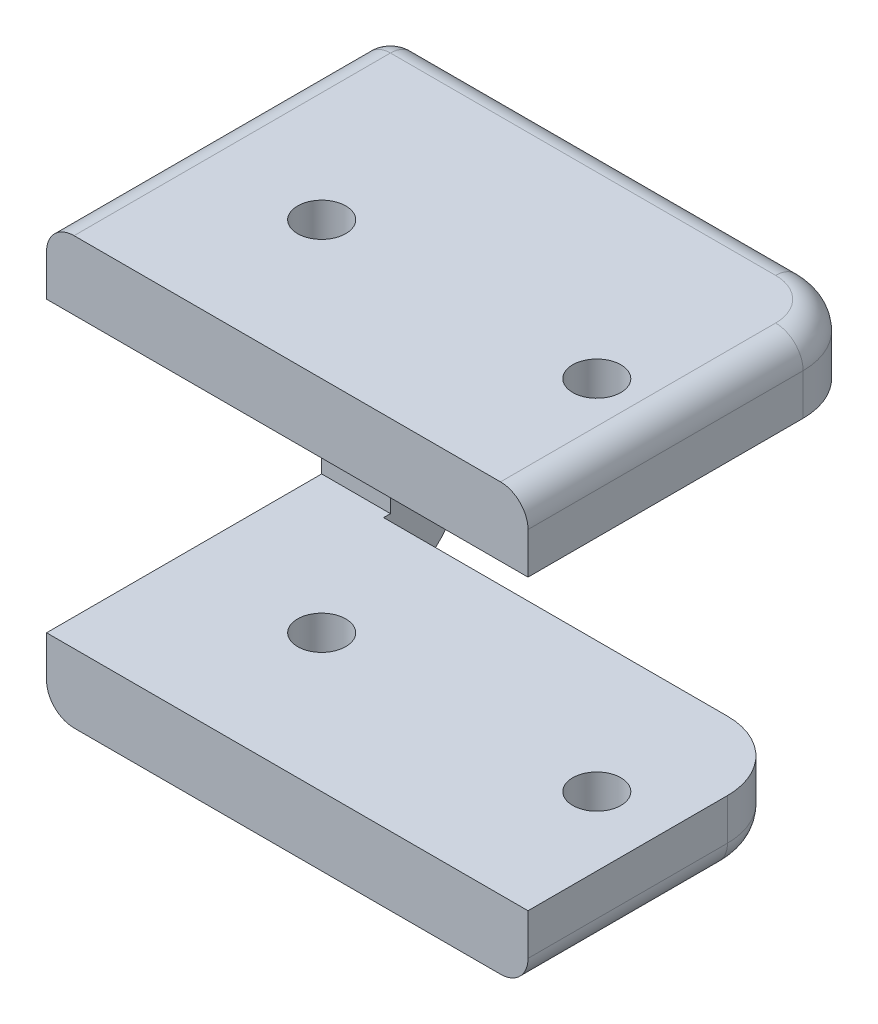
ISO-10303-21;
HEADER;
FILE_DESCRIPTION(('STEP AP214'),'2;1');
FILE_NAME('part.step','',(''),(''),'','','');
FILE_SCHEMA(('AUTOMOTIVE_DESIGN { 1 0 10303 214 1 1 1 1 }'));
ENDSEC;
DATA;
#1=APPLICATION_CONTEXT('core data for automotive mechanical design processes');
#2=APPLICATION_PROTOCOL_DEFINITION('international standard','automotive_design',2000,#1);
#3=PRODUCT_CONTEXT('',#1,'mechanical');
#4=PRODUCT('Part','Part','',(#3));
#5=PRODUCT_RELATED_PRODUCT_CATEGORY('part','',(#4));
#6=PRODUCT_DEFINITION_FORMATION('','',#4);
#7=PRODUCT_DEFINITION_CONTEXT('part definition',#1,'design');
#8=PRODUCT_DEFINITION('design','',#6,#7);
#9=PRODUCT_DEFINITION_SHAPE('','',#8);
#10=(LENGTH_UNIT() NAMED_UNIT(*) SI_UNIT(.MILLI.,.METRE.));
#11=(NAMED_UNIT(*) PLANE_ANGLE_UNIT() SI_UNIT($,.RADIAN.));
#12=(NAMED_UNIT(*) SI_UNIT($,.STERADIAN.) SOLID_ANGLE_UNIT());
#13=UNCERTAINTY_MEASURE_WITH_UNIT(LENGTH_MEASURE(1.E-05),#10,'distance_accuracy_value','');
#14=(GEOMETRIC_REPRESENTATION_CONTEXT(3) GLOBAL_UNCERTAINTY_ASSIGNED_CONTEXT((#13)) GLOBAL_UNIT_ASSIGNED_CONTEXT((#10,
#11,#12)) REPRESENTATION_CONTEXT('',''));
#15=CARTESIAN_POINT('',(0.,0.,0.));
#16=DIRECTION('',(0.,0.,1.));
#17=DIRECTION('',(1.,0.,0.));
#18=AXIS2_PLACEMENT_3D('',#15,#16,#17);
#19=CARTESIAN_POINT('',(-15.,0.,0.));
#20=DIRECTION('',(-1.,0.,0.));
#21=DIRECTION('',(0.,0.,1.));
#22=AXIS2_PLACEMENT_3D('',#19,#20,#21);
#23=PLANE('',#22);
#24=DIRECTION('',(0.,0.,1.));
#25=VECTOR('',#24,1.);
#26=CARTESIAN_POINT('',(-15.,-26.,-12.5));
#27=LINE('',#26,#25);
#28=CARTESIAN_POINT('',(-15.,-26.,-7.5));
#29=VERTEX_POINT('',#28);
#30=CARTESIAN_POINT('',(-15.,-26.,-4.99999999999999));
#31=VERTEX_POINT('',#30);
#32=EDGE_CURVE('E234',#29,#31,#27,.T.);
#33=ORIENTED_EDGE('',*,*,#32,.F.);
#34=CARTESIAN_POINT('',(-15.,-21.,-7.5));
#35=DIRECTION('',(-1.,0.,0.));
#36=DIRECTION('',(0.,0.,1.));
#37=AXIS2_PLACEMENT_3D('',#34,#35,#36);
#38=CIRCLE('',#37,5.);
#39=CARTESIAN_POINT('',(-15.,-21.,-12.5));
#40=VERTEX_POINT('',#39);
#41=EDGE_CURVE('E280',#29,#40,#38,.F.);
#42=ORIENTED_EDGE('',*,*,#41,.T.);
#43=DIRECTION('',(0.,-1.,0.));
#44=VECTOR('',#43,1.);
#45=CARTESIAN_POINT('',(-15.,5.,-12.5));
#46=LINE('',#45,#44);
#47=CARTESIAN_POINT('',(-15.,0.,-12.5));
#48=VERTEX_POINT('',#47);
#49=EDGE_CURVE('E218',#48,#40,#46,.T.);
#50=ORIENTED_EDGE('',*,*,#49,.F.);
#51=DIRECTION('',(0.,0.,1.));
#52=VECTOR('',#51,1.);
#53=CARTESIAN_POINT('',(-15.,0.,-12.5));
#54=LINE('',#53,#52);
#55=CARTESIAN_POINT('',(-15.,0.,-7.49999999999999));
#56=VERTEX_POINT('',#55);
#57=EDGE_CURVE('E267',#48,#56,#54,.T.);
#58=ORIENTED_EDGE('',*,*,#57,.T.);
#59=DIRECTION('',(0.,1.,0.));
#60=VECTOR('',#59,1.);
#61=CARTESIAN_POINT('',(-15.,-21.,-7.49999999999999));
#62=LINE('',#61,#60);
#63=CARTESIAN_POINT('',(-15.,-21.,-7.49999999999999));
#64=VERTEX_POINT('',#63);
#65=EDGE_CURVE('E221',#64,#56,#62,.T.);
#66=ORIENTED_EDGE('',*,*,#65,.F.);
#67=DIRECTION('',(0.,0.,-1.));
#68=VECTOR('',#67,1.);
#69=CARTESIAN_POINT('',(-15.,-21.,12.5));
#70=LINE('',#69,#68);
#71=CARTESIAN_POINT('',(-15.,-21.,-6.99999999999999));
#72=VERTEX_POINT('',#71);
#73=EDGE_CURVE('E236',#72,#64,#70,.T.);
#74=ORIENTED_EDGE('',*,*,#73,.F.);
#75=DIRECTION('',(0.,1.,0.));
#76=VECTOR('',#75,1.);
#77=CARTESIAN_POINT('',(-15.,-26.,-6.99999999999999));
#78=LINE('',#77,#76);
#79=CARTESIAN_POINT('',(-15.,-24.,-6.99999999999999));
#80=VERTEX_POINT('',#79);
#81=EDGE_CURVE('E208',#80,#72,#78,.T.);
#82=ORIENTED_EDGE('',*,*,#81,.F.);
#83=CARTESIAN_POINT('',(-15.,-24.,-4.99999999999999));
#84=DIRECTION('',(-1.,0.,0.));
#85=DIRECTION('',(0.,0.,1.));
#86=AXIS2_PLACEMENT_3D('',#83,#84,#85);
#87=CIRCLE('',#86,2.);
#88=EDGE_CURVE('E11',#80,#31,#87,.T.);
#89=ORIENTED_EDGE('',*,*,#88,.T.);
#90=EDGE_LOOP('',(#33,#42,#50,#58,#66,#74,#82,#89));
#91=FACE_BOUND('',#90,.T.);
#92=ADVANCED_FACE('F36',(#91),#23,.F.);
#93=CARTESIAN_POINT('',(0.,5.,0.));
#94=DIRECTION('',(0.,1.,0.));
#95=DIRECTION('',(0.,0.,1.));
#96=AXIS2_PLACEMENT_3D('',#93,#94,#95);
#97=PLANE('',#96);
#98=CARTESIAN_POINT('',(-10.,5.,2.50000000000001));
#99=DIRECTION('',(0.,1.,0.));
#100=DIRECTION('',(0.,0.,1.));
#101=AXIS2_PLACEMENT_3D('',#98,#99,#100);
#102=CIRCLE('',#101,1.75000000000001);
#103=CARTESIAN_POINT('',(-10.,5.,4.25000000000002));
#104=VERTEX_POINT('',#103);
#105=EDGE_CURVE('E252',#104,#104,#102,.T.);
#106=ORIENTED_EDGE('',*,*,#105,.F.);
#107=EDGE_LOOP('',(#106));
#108=FACE_BOUND('',#107,.T.);
#109=DIRECTION('',(1.,0.,0.));
#110=VECTOR('',#109,1.);
#111=CARTESIAN_POINT('',(-15.,5.,12.5));
#112=LINE('',#111,#110);
#113=CARTESIAN_POINT('',(-18.,5.,12.5));
#114=VERTEX_POINT('',#113);
#115=CARTESIAN_POINT('',(13.,5.,12.5));
#116=VERTEX_POINT('',#115);
#117=EDGE_CURVE('E258',#114,#116,#112,.T.);
#118=ORIENTED_EDGE('',*,*,#117,.T.);
#119=DIRECTION('',(0.,0.,-1.));
#120=VECTOR('',#119,1.);
#121=CARTESIAN_POINT('',(13.,5.,-7.5));
#122=LINE('',#121,#120);
#123=CARTESIAN_POINT('',(13.,5.,-7.5));
#124=VERTEX_POINT('',#123);
#125=EDGE_CURVE('E328',#116,#124,#122,.T.);
#126=ORIENTED_EDGE('',*,*,#125,.T.);
#127=CARTESIAN_POINT('',(10.,5.,-7.5));
#128=DIRECTION('',(0.,1.,0.));
#129=DIRECTION('',(0.,0.,1.));
#130=AXIS2_PLACEMENT_3D('',#127,#128,#129);
#131=CIRCLE('',#130,3.);
#132=CARTESIAN_POINT('',(10.,5.,-10.5));
#133=VERTEX_POINT('',#132);
#134=EDGE_CURVE('E326',#124,#133,#131,.T.);
#135=ORIENTED_EDGE('',*,*,#134,.T.);
#136=DIRECTION('',(-1.,0.,0.));
#137=VECTOR('',#136,1.);
#138=CARTESIAN_POINT('',(-20.,5.,-10.5));
#139=LINE('',#138,#137);
#140=CARTESIAN_POINT('',(-18.,5.,-10.5));
#141=VERTEX_POINT('',#140);
#142=EDGE_CURVE('E324',#133,#141,#139,.T.);
#143=ORIENTED_EDGE('',*,*,#142,.T.);
#144=DIRECTION('',(0.,0.,-1.));
#145=VECTOR('',#144,1.);
#146=CARTESIAN_POINT('',(-18.,5.,0.));
#147=LINE('',#146,#145);
#148=EDGE_CURVE('E322',#141,#114,#147,.F.);
#149=ORIENTED_EDGE('',*,*,#148,.T.);
#150=EDGE_LOOP('',(#118,#126,#135,#143,#149));
#151=FACE_BOUND('',#150,.T.);
#152=CARTESIAN_POINT('',(10.,5.,2.50000000000001));
#153=DIRECTION('',(0.,1.,0.));
#154=DIRECTION('',(0.,0.,1.));
#155=AXIS2_PLACEMENT_3D('',#152,#153,#154);
#156=CIRCLE('',#155,1.74999999999987);
#157=CARTESIAN_POINT('',(10.,5.,4.24999999999988));
#158=VERTEX_POINT('',#157);
#159=EDGE_CURVE('E246',#158,#158,#156,.T.);
#160=ORIENTED_EDGE('',*,*,#159,.F.);
#161=EDGE_LOOP('',(#160));
#162=FACE_BOUND('',#161,.T.);
#163=ADVANCED_FACE('F380',(#108,#151,#162),#97,.T.);
#164=CARTESIAN_POINT('',(0.,0.,0.));
#165=DIRECTION('',(0.,1.,0.));
#166=DIRECTION('',(0.,0.,1.));
#167=AXIS2_PLACEMENT_3D('',#164,#165,#166);
#168=PLANE('',#167);
#169=DIRECTION('',(-1.,0.,0.));
#170=VECTOR('',#169,1.);
#171=CARTESIAN_POINT('',(-15.,0.,-12.5));
#172=LINE('',#171,#170);
#173=CARTESIAN_POINT('',(10.,0.,-12.5));
#174=VERTEX_POINT('',#173);
#175=EDGE_CURVE('E265',#174,#48,#172,.T.);
#176=ORIENTED_EDGE('',*,*,#175,.F.);
#177=CARTESIAN_POINT('',(10.,0.,-7.5));
#178=DIRECTION('',(0.,1.,0.));
#179=DIRECTION('',(0.,0.,1.));
#180=AXIS2_PLACEMENT_3D('',#177,#178,#179);
#181=CIRCLE('',#180,5.);
#182=CARTESIAN_POINT('',(15.,0.,-7.5));
#183=VERTEX_POINT('',#182);
#184=EDGE_CURVE('E292',#174,#183,#181,.F.);
#185=ORIENTED_EDGE('',*,*,#184,.T.);
#186=DIRECTION('',(0.,0.,-1.));
#187=VECTOR('',#186,1.);
#188=CARTESIAN_POINT('',(15.,0.,-12.5));
#189=LINE('',#188,#187);
#190=CARTESIAN_POINT('',(15.,0.,12.5));
#191=VERTEX_POINT('',#190);
#192=EDGE_CURVE('E255',#191,#183,#189,.T.);
#193=ORIENTED_EDGE('',*,*,#192,.F.);
#194=DIRECTION('',(1.,0.,0.));
#195=VECTOR('',#194,1.);
#196=CARTESIAN_POINT('',(-15.,0.,12.5));
#197=LINE('',#196,#195);
#198=CARTESIAN_POINT('',(-20.,0.,12.5));
#199=VERTEX_POINT('',#198);
#200=EDGE_CURVE('E262',#199,#191,#197,.T.);
#201=ORIENTED_EDGE('',*,*,#200,.F.);
#202=DIRECTION('',(0.,0.,1.));
#203=VECTOR('',#202,1.);
#204=CARTESIAN_POINT('',(-20.,0.,12.5));
#205=LINE('',#204,#203);
#206=CARTESIAN_POINT('',(-20.,0.,-7.49999999999999));
#207=VERTEX_POINT('',#206);
#208=EDGE_CURVE('E225',#207,#199,#205,.T.);
#209=ORIENTED_EDGE('',*,*,#208,.F.);
#210=DIRECTION('',(1.,0.,0.));
#211=VECTOR('',#210,1.);
#212=CARTESIAN_POINT('',(-20.,0.,-7.49999999999999));
#213=LINE('',#212,#211);
#214=EDGE_CURVE('E231',#207,#56,#213,.T.);
#215=ORIENTED_EDGE('',*,*,#214,.T.);
#216=ORIENTED_EDGE('',*,*,#57,.F.);
#217=EDGE_LOOP('',(#176,#185,#193,#201,#209,#215,#216));
#218=FACE_BOUND('',#217,.T.);
#219=CARTESIAN_POINT('',(-10.,0.,2.50000000000001));
#220=DIRECTION('',(0.,1.,0.));
#221=DIRECTION('',(0.,0.,1.));
#222=AXIS2_PLACEMENT_3D('',#219,#220,#221);
#223=CIRCLE('',#222,1.75000000000001);
#224=CARTESIAN_POINT('',(-10.,0.,4.25000000000002));
#225=VERTEX_POINT('',#224);
#226=EDGE_CURVE('E249',#225,#225,#223,.T.);
#227=ORIENTED_EDGE('',*,*,#226,.T.);
#228=EDGE_LOOP('',(#227));
#229=FACE_BOUND('',#228,.T.);
#230=CARTESIAN_POINT('',(10.,0.,2.50000000000001));
#231=DIRECTION('',(0.,1.,0.));
#232=DIRECTION('',(0.,0.,1.));
#233=AXIS2_PLACEMENT_3D('',#230,#231,#232);
#234=CIRCLE('',#233,1.74999999999987);
#235=CARTESIAN_POINT('',(10.,0.,4.24999999999988));
#236=VERTEX_POINT('',#235);
#237=EDGE_CURVE('E245',#236,#236,#234,.T.);
#238=ORIENTED_EDGE('',*,*,#237,.T.);
#239=EDGE_LOOP('',(#238));
#240=FACE_BOUND('',#239,.T.);
#241=ADVANCED_FACE('F406',(#218,#229,#240),#168,.F.);
#242=CARTESIAN_POINT('',(15.,5.,-12.5));
#243=DIRECTION('',(-1.,0.,0.));
#244=DIRECTION('',(0.,0.,1.));
#245=AXIS2_PLACEMENT_3D('',#242,#243,#244);
#246=PLANE('',#245);
#247=DIRECTION('',(0.,-1.,0.));
#248=VECTOR('',#247,1.);
#249=CARTESIAN_POINT('',(15.,5.,-7.5));
#250=LINE('',#249,#248);
#251=CARTESIAN_POINT('',(15.,3.,-7.5));
#252=VERTEX_POINT('',#251);
#253=EDGE_CURVE('E294',#183,#252,#250,.F.);
#254=ORIENTED_EDGE('',*,*,#253,.T.);
#255=DIRECTION('',(0.,0.,-1.));
#256=VECTOR('',#255,1.);
#257=CARTESIAN_POINT('',(15.,3.,12.5));
#258=LINE('',#257,#256);
#259=CARTESIAN_POINT('',(15.,3.,12.5));
#260=VERTEX_POINT('',#259);
#261=EDGE_CURVE('E53',#252,#260,#258,.F.);
#262=ORIENTED_EDGE('',*,*,#261,.T.);
#263=DIRECTION('',(0.,-1.,0.));
#264=VECTOR('',#263,1.);
#265=CARTESIAN_POINT('',(15.,5.,12.5));
#266=LINE('',#265,#264);
#267=EDGE_CURVE('E261',#260,#191,#266,.T.);
#268=ORIENTED_EDGE('',*,*,#267,.T.);
#269=ORIENTED_EDGE('',*,*,#192,.T.);
#270=EDGE_LOOP('',(#254,#262,#268,#269));
#271=FACE_BOUND('',#270,.T.);
#272=ADVANCED_FACE('F410',(#271),#246,.F.);
#273=CARTESIAN_POINT('',(-15.,5.,-12.5));
#274=DIRECTION('',(0.,0.,1.));
#275=DIRECTION('',(1.,0.,0.));
#276=AXIS2_PLACEMENT_3D('',#273,#274,#275);
#277=PLANE('',#276);
#278=DIRECTION('',(0.,-1.,0.));
#279=VECTOR('',#278,1.);
#280=CARTESIAN_POINT('',(-18.,5.,-12.5));
#281=LINE('',#280,#279);
#282=CARTESIAN_POINT('',(-18.,-21.,-12.5));
#283=VERTEX_POINT('',#282);
#284=CARTESIAN_POINT('',(-18.,3.,-12.5));
#285=VERTEX_POINT('',#284);
#286=EDGE_CURVE('E330',#283,#285,#281,.F.);
#287=ORIENTED_EDGE('',*,*,#286,.T.);
#288=DIRECTION('',(-1.,0.,0.));
#289=VECTOR('',#288,1.);
#290=CARTESIAN_POINT('',(10.,3.,-12.5));
#291=LINE('',#290,#289);
#292=CARTESIAN_POINT('',(10.,3.,-12.5));
#293=VERTEX_POINT('',#292);
#294=EDGE_CURVE('E332',#285,#293,#291,.F.);
#295=ORIENTED_EDGE('',*,*,#294,.T.);
#296=DIRECTION('',(0.,-1.,0.));
#297=VECTOR('',#296,1.);
#298=CARTESIAN_POINT('',(10.,5.,-12.5));
#299=LINE('',#298,#297);
#300=EDGE_CURVE('E282',#293,#174,#299,.T.);
#301=ORIENTED_EDGE('',*,*,#300,.T.);
#302=ORIENTED_EDGE('',*,*,#175,.T.);
#303=ORIENTED_EDGE('',*,*,#49,.T.);
#304=DIRECTION('',(1.,0.,0.));
#305=VECTOR('',#304,1.);
#306=CARTESIAN_POINT('',(-15.,-21.,-12.5));
#307=LINE('',#306,#305);
#308=EDGE_CURVE('E284',#40,#283,#307,.F.);
#309=ORIENTED_EDGE('',*,*,#308,.T.);
#310=EDGE_LOOP('',(#287,#295,#301,#302,#303,#309));
#311=FACE_BOUND('',#310,.T.);
#312=ADVANCED_FACE('F415',(#311),#277,.F.);
#313=CARTESIAN_POINT('',(-15.,5.,12.5));
#314=DIRECTION('',(0.,0.,-1.));
#315=DIRECTION('',(-1.,0.,0.));
#316=AXIS2_PLACEMENT_3D('',#313,#314,#315);
#317=PLANE('',#316);
#318=ORIENTED_EDGE('',*,*,#267,.F.);
#319=CARTESIAN_POINT('',(13.,3.,12.5));
#320=DIRECTION('',(0.,0.,-1.));
#321=DIRECTION('',(-1.,0.,0.));
#322=AXIS2_PLACEMENT_3D('',#319,#320,#321);
#323=CIRCLE('',#322,2.);
#324=EDGE_CURVE('E45',#260,#116,#323,.F.);
#325=ORIENTED_EDGE('',*,*,#324,.T.);
#326=ORIENTED_EDGE('',*,*,#117,.F.);
#327=CARTESIAN_POINT('',(-18.,3.,12.5));
#328=DIRECTION('',(0.,0.,-1.));
#329=DIRECTION('',(-1.,0.,0.));
#330=AXIS2_PLACEMENT_3D('',#327,#328,#329);
#331=CIRCLE('',#330,2.);
#332=CARTESIAN_POINT('',(-20.,3.,12.5));
#333=VERTEX_POINT('',#332);
#334=EDGE_CURVE('E338',#114,#333,#331,.F.);
#335=ORIENTED_EDGE('',*,*,#334,.T.);
#336=DIRECTION('',(0.,1.,0.));
#337=VECTOR('',#336,1.);
#338=CARTESIAN_POINT('',(-20.,5.,12.5));
#339=LINE('',#338,#337);
#340=EDGE_CURVE('E228',#199,#333,#339,.T.);
#341=ORIENTED_EDGE('',*,*,#340,.F.);
#342=ORIENTED_EDGE('',*,*,#200,.T.);
#343=EDGE_LOOP('',(#318,#325,#326,#335,#341,#342));
#344=FACE_BOUND('',#343,.T.);
#345=ADVANCED_FACE('F377',(#344),#317,.F.);
#346=CARTESIAN_POINT('',(-10.,5.,2.50000000000001));
#347=DIRECTION('',(0.,-1.,0.));
#348=DIRECTION('',(0.,0.,-1.));
#349=AXIS2_PLACEMENT_3D('',#346,#347,#348);
#350=CYLINDRICAL_SURFACE('',#349,1.75000000000001);
#351=ORIENTED_EDGE('',*,*,#105,.T.);
#352=EDGE_LOOP('',(#351));
#353=FACE_BOUND('',#352,.T.);
#354=ORIENTED_EDGE('',*,*,#226,.F.);
#355=EDGE_LOOP('',(#354));
#356=FACE_BOUND('',#355,.T.);
#357=ADVANCED_FACE('F492',(#353,#356),#350,.F.);
#358=CARTESIAN_POINT('',(10.,5.,2.50000000000001));
#359=DIRECTION('',(0.,-1.,0.));
#360=DIRECTION('',(0.,0.,-1.));
#361=AXIS2_PLACEMENT_3D('',#358,#359,#360);
#362=CYLINDRICAL_SURFACE('',#361,1.74999999999987);
#363=ORIENTED_EDGE('',*,*,#159,.T.);
#364=EDGE_LOOP('',(#363));
#365=FACE_BOUND('',#364,.T.);
#366=ORIENTED_EDGE('',*,*,#237,.F.);
#367=EDGE_LOOP('',(#366));
#368=FACE_BOUND('',#367,.T.);
#369=ADVANCED_FACE('F488',(#365,#368),#362,.F.);
#370=CARTESIAN_POINT('',(-20.,-26.,-12.5));
#371=DIRECTION('',(0.,1.,0.));
#372=DIRECTION('',(0.,0.,1.));
#373=AXIS2_PLACEMENT_3D('',#370,#371,#372);
#374=PLANE('',#373);
#375=CARTESIAN_POINT('',(-10.,-26.,2.50000000000001));
#376=DIRECTION('',(0.,-1.,0.));
#377=DIRECTION('',(0.,0.,-1.));
#378=AXIS2_PLACEMENT_3D('',#375,#376,#377);
#379=CIRCLE('',#378,1.75);
#380=CARTESIAN_POINT('',(-10.,-26.,0.75000000000001));
#381=VERTEX_POINT('',#380);
#382=EDGE_CURVE('E276',#381,#381,#379,.T.);
#383=ORIENTED_EDGE('',*,*,#382,.F.);
#384=EDGE_LOOP('',(#383));
#385=FACE_BOUND('',#384,.T.);
#386=CARTESIAN_POINT('',(10.,-26.,2.50000000000001));
#387=DIRECTION('',(0.,-1.,0.));
#388=DIRECTION('',(0.,0.,-1.));
#389=AXIS2_PLACEMENT_3D('',#386,#387,#388);
#390=CIRCLE('',#389,1.75);
#391=CARTESIAN_POINT('',(10.,-26.,0.75000000000001));
#392=VERTEX_POINT('',#391);
#393=EDGE_CURVE('E213',#392,#392,#390,.T.);
#394=ORIENTED_EDGE('',*,*,#393,.F.);
#395=EDGE_LOOP('',(#394));
#396=FACE_BOUND('',#395,.T.);
#397=DIRECTION('',(1.,0.,0.));
#398=VECTOR('',#397,1.);
#399=CARTESIAN_POINT('',(-20.,-26.,12.5));
#400=LINE('',#399,#398);
#401=CARTESIAN_POINT('',(-18.,-26.,12.5));
#402=VERTEX_POINT('',#401);
#403=CARTESIAN_POINT('',(13.,-26.,12.5));
#404=VERTEX_POINT('',#403);
#405=EDGE_CURVE('E201',#402,#404,#400,.T.);
#406=ORIENTED_EDGE('',*,*,#405,.F.);
#407=DIRECTION('',(0.,0.,1.));
#408=VECTOR('',#407,1.);
#409=CARTESIAN_POINT('',(-18.,-26.,-7.5));
#410=LINE('',#409,#408);
#411=CARTESIAN_POINT('',(-18.,-26.,-7.5));
#412=VERTEX_POINT('',#411);
#413=EDGE_CURVE('E304',#402,#412,#410,.F.);
#414=ORIENTED_EDGE('',*,*,#413,.T.);
#415=DIRECTION('',(1.,0.,0.));
#416=VECTOR('',#415,1.);
#417=CARTESIAN_POINT('',(-20.,-26.,-7.5));
#418=LINE('',#417,#416);
#419=EDGE_CURVE('E272',#412,#29,#418,.T.);
#420=ORIENTED_EDGE('',*,*,#419,.T.);
#421=ORIENTED_EDGE('',*,*,#32,.T.);
#422=DIRECTION('',(-1.,0.,0.));
#423=VECTOR('',#422,1.);
#424=CARTESIAN_POINT('',(-20.,-26.,-4.99999999999999));
#425=LINE('',#424,#423);
#426=CARTESIAN_POINT('',(10.,-26.,-4.99999999999999));
#427=VERTEX_POINT('',#426);
#428=EDGE_CURVE('E298',#31,#427,#425,.F.);
#429=ORIENTED_EDGE('',*,*,#428,.T.);
#430=CARTESIAN_POINT('',(10.,-26.,-1.99999999999999));
#431=DIRECTION('',(0.,1.,0.));
#432=DIRECTION('',(0.,0.,1.));
#433=AXIS2_PLACEMENT_3D('',#430,#431,#432);
#434=CIRCLE('',#433,3.);
#435=CARTESIAN_POINT('',(13.,-26.,-1.99999999999999));
#436=VERTEX_POINT('',#435);
#437=EDGE_CURVE('E300',#427,#436,#434,.F.);
#438=ORIENTED_EDGE('',*,*,#437,.T.);
#439=DIRECTION('',(0.,0.,-1.));
#440=VECTOR('',#439,1.);
#441=CARTESIAN_POINT('',(13.,-26.,-12.5));
#442=LINE('',#441,#440);
#443=EDGE_CURVE('E302',#436,#404,#442,.F.);
#444=ORIENTED_EDGE('',*,*,#443,.T.);
#445=EDGE_LOOP('',(#406,#414,#420,#421,#429,#438,#444));
#446=FACE_BOUND('',#445,.T.);
#447=ADVANCED_FACE('F427',(#385,#396,#446),#374,.F.);
#448=CARTESIAN_POINT('',(-20.,-21.,12.5));
#449=DIRECTION('',(0.,0.,-1.));
#450=DIRECTION('',(-1.,0.,0.));
#451=AXIS2_PLACEMENT_3D('',#448,#449,#450);
#452=PLANE('',#451);
#453=ORIENTED_EDGE('',*,*,#405,.T.);
#454=CARTESIAN_POINT('',(13.,-24.,12.5));
#455=DIRECTION('',(0.,0.,-1.));
#456=DIRECTION('',(-1.,0.,0.));
#457=AXIS2_PLACEMENT_3D('',#454,#455,#456);
#458=CIRCLE('',#457,2.);
#459=CARTESIAN_POINT('',(15.,-24.,12.5));
#460=VERTEX_POINT('',#459);
#461=EDGE_CURVE('E207',#404,#460,#458,.F.);
#462=ORIENTED_EDGE('',*,*,#461,.T.);
#463=DIRECTION('',(0.,-1.,0.));
#464=VECTOR('',#463,1.);
#465=CARTESIAN_POINT('',(15.,-26.,12.5));
#466=LINE('',#465,#464);
#467=CARTESIAN_POINT('',(15.,-21.,12.5));
#468=VERTEX_POINT('',#467);
#469=EDGE_CURVE('E185',#468,#460,#466,.T.);
#470=ORIENTED_EDGE('',*,*,#469,.F.);
#471=DIRECTION('',(1.,0.,0.));
#472=VECTOR('',#471,1.);
#473=CARTESIAN_POINT('',(-20.,-21.,12.5));
#474=LINE('',#473,#472);
#475=CARTESIAN_POINT('',(-20.,-21.,12.5));
#476=VERTEX_POINT('',#475);
#477=EDGE_CURVE('E195',#476,#468,#474,.T.);
#478=ORIENTED_EDGE('',*,*,#477,.F.);
#479=DIRECTION('',(0.,1.,0.));
#480=VECTOR('',#479,1.);
#481=CARTESIAN_POINT('',(-20.,-21.,12.5));
#482=LINE('',#481,#480);
#483=CARTESIAN_POINT('',(-20.,-24.,12.5));
#484=VERTEX_POINT('',#483);
#485=EDGE_CURVE('E219',#484,#476,#482,.T.);
#486=ORIENTED_EDGE('',*,*,#485,.F.);
#487=CARTESIAN_POINT('',(-18.,-24.,12.5));
#488=DIRECTION('',(0.,0.,-1.));
#489=DIRECTION('',(-1.,0.,0.));
#490=AXIS2_PLACEMENT_3D('',#487,#488,#489);
#491=CIRCLE('',#490,2.);
#492=EDGE_CURVE('E306',#484,#402,#491,.F.);
#493=ORIENTED_EDGE('',*,*,#492,.T.);
#494=EDGE_LOOP('',(#453,#462,#470,#478,#486,#493));
#495=FACE_BOUND('',#494,.T.);
#496=ADVANCED_FACE('F205',(#495),#452,.F.);
#497=CARTESIAN_POINT('',(-20.,-21.,12.5));
#498=DIRECTION('',(0.,-1.,0.));
#499=DIRECTION('',(0.,0.,-1.));
#500=AXIS2_PLACEMENT_3D('',#497,#498,#499);
#501=PLANE('',#500);
#502=CARTESIAN_POINT('',(-10.,-21.,2.50000000000001));
#503=DIRECTION('',(0.,-1.,0.));
#504=DIRECTION('',(0.,0.,-1.));
#505=AXIS2_PLACEMENT_3D('',#502,#503,#504);
#506=CIRCLE('',#505,1.75);
#507=CARTESIAN_POINT('',(-10.,-21.,0.75000000000001));
#508=VERTEX_POINT('',#507);
#509=EDGE_CURVE('E210',#508,#508,#506,.T.);
#510=ORIENTED_EDGE('',*,*,#509,.T.);
#511=EDGE_LOOP('',(#510));
#512=FACE_BOUND('',#511,.T.);
#513=CARTESIAN_POINT('',(10.,-21.,2.50000000000001));
#514=DIRECTION('',(0.,-1.,0.));
#515=DIRECTION('',(0.,0.,-1.));
#516=AXIS2_PLACEMENT_3D('',#513,#514,#515);
#517=CIRCLE('',#516,1.75);
#518=CARTESIAN_POINT('',(10.,-21.,0.75000000000001));
#519=VERTEX_POINT('',#518);
#520=EDGE_CURVE('E273',#519,#519,#517,.T.);
#521=ORIENTED_EDGE('',*,*,#520,.T.);
#522=EDGE_LOOP('',(#521));
#523=FACE_BOUND('',#522,.T.);
#524=DIRECTION('',(0.,0.,1.));
#525=VECTOR('',#524,1.);
#526=CARTESIAN_POINT('',(15.,-21.,12.5));
#527=LINE('',#526,#525);
#528=CARTESIAN_POINT('',(15.,-21.,-1.99999999999999));
#529=VERTEX_POINT('',#528);
#530=EDGE_CURVE('E180',#529,#468,#527,.T.);
#531=ORIENTED_EDGE('',*,*,#530,.F.);
#532=CARTESIAN_POINT('',(10.,-21.,-1.99999999999999));
#533=DIRECTION('',(0.,-1.,0.));
#534=DIRECTION('',(0.,0.,-1.));
#535=AXIS2_PLACEMENT_3D('',#532,#533,#534);
#536=CIRCLE('',#535,5.);
#537=CARTESIAN_POINT('',(10.,-21.,-6.99999999999999));
#538=VERTEX_POINT('',#537);
#539=EDGE_CURVE('E288',#529,#538,#536,.F.);
#540=ORIENTED_EDGE('',*,*,#539,.T.);
#541=DIRECTION('',(-1.,0.,0.));
#542=VECTOR('',#541,1.);
#543=CARTESIAN_POINT('',(15.,-21.,-6.99999999999999));
#544=LINE('',#543,#542);
#545=EDGE_CURVE('E191',#538,#72,#544,.T.);
#546=ORIENTED_EDGE('',*,*,#545,.T.);
#547=ORIENTED_EDGE('',*,*,#73,.T.);
#548=DIRECTION('',(1.,0.,0.));
#549=VECTOR('',#548,1.);
#550=CARTESIAN_POINT('',(-20.,-21.,-7.49999999999999));
#551=LINE('',#550,#549);
#552=CARTESIAN_POINT('',(-20.,-21.,-7.49999999999999));
#553=VERTEX_POINT('',#552);
#554=EDGE_CURVE('E202',#553,#64,#551,.T.);
#555=ORIENTED_EDGE('',*,*,#554,.F.);
#556=DIRECTION('',(0.,0.,-1.));
#557=VECTOR('',#556,1.);
#558=CARTESIAN_POINT('',(-20.,-21.,12.5));
#559=LINE('',#558,#557);
#560=EDGE_CURVE('E198',#476,#553,#559,.T.);
#561=ORIENTED_EDGE('',*,*,#560,.F.);
#562=ORIENTED_EDGE('',*,*,#477,.T.);
#563=EDGE_LOOP('',(#531,#540,#546,#547,#555,#561,#562));
#564=FACE_BOUND('',#563,.T.);
#565=ADVANCED_FACE('F196',(#512,#523,#564),#501,.F.);
#566=CARTESIAN_POINT('',(-20.,-21.,-7.49999999999999));
#567=DIRECTION('',(0.,0.,-1.));
#568=DIRECTION('',(0.,1.,0.));
#569=AXIS2_PLACEMENT_3D('',#566,#567,#568);
#570=PLANE('',#569);
#571=ORIENTED_EDGE('',*,*,#65,.T.);
#572=ORIENTED_EDGE('',*,*,#214,.F.);
#573=DIRECTION('',(0.,1.,0.));
#574=VECTOR('',#573,1.);
#575=CARTESIAN_POINT('',(-20.,-21.,-7.49999999999999));
#576=LINE('',#575,#574);
#577=EDGE_CURVE('E223',#553,#207,#576,.T.);
#578=ORIENTED_EDGE('',*,*,#577,.F.);
#579=ORIENTED_EDGE('',*,*,#554,.T.);
#580=EDGE_LOOP('',(#571,#572,#578,#579));
#581=FACE_BOUND('',#580,.T.);
#582=ADVANCED_FACE('F477',(#581),#570,.F.);
#583=CARTESIAN_POINT('',(-20.,0.,0.));
#584=DIRECTION('',(-1.,0.,0.));
#585=DIRECTION('',(0.,0.,1.));
#586=AXIS2_PLACEMENT_3D('',#583,#584,#585);
#587=PLANE('',#586);
#588=CARTESIAN_POINT('',(-20.,-21.,-7.5));
#589=DIRECTION('',(-1.,0.,0.));
#590=DIRECTION('',(0.,0.,1.));
#591=AXIS2_PLACEMENT_3D('',#588,#589,#590);
#592=CIRCLE('',#591,3.);
#593=CARTESIAN_POINT('',(-20.,-21.,-10.5));
#594=VERTEX_POINT('',#593);
#595=CARTESIAN_POINT('',(-20.,-24.,-7.5));
#596=VERTEX_POINT('',#595);
#597=EDGE_CURVE('E315',#594,#596,#592,.T.);
#598=ORIENTED_EDGE('',*,*,#597,.T.);
#599=DIRECTION('',(0.,0.,1.));
#600=VECTOR('',#599,1.);
#601=CARTESIAN_POINT('',(-20.,-24.,12.5));
#602=LINE('',#601,#600);
#603=EDGE_CURVE('E317',#596,#484,#602,.T.);
#604=ORIENTED_EDGE('',*,*,#603,.T.);
#605=ORIENTED_EDGE('',*,*,#485,.T.);
#606=ORIENTED_EDGE('',*,*,#560,.T.);
#607=ORIENTED_EDGE('',*,*,#577,.T.);
#608=ORIENTED_EDGE('',*,*,#208,.T.);
#609=ORIENTED_EDGE('',*,*,#340,.T.);
#610=DIRECTION('',(0.,0.,-1.));
#611=VECTOR('',#610,1.);
#612=CARTESIAN_POINT('',(-20.,3.,0.));
#613=LINE('',#612,#611);
#614=CARTESIAN_POINT('',(-20.,3.,-10.5));
#615=VERTEX_POINT('',#614);
#616=EDGE_CURVE('E311',#333,#615,#613,.T.);
#617=ORIENTED_EDGE('',*,*,#616,.T.);
#618=DIRECTION('',(0.,-1.,0.));
#619=VECTOR('',#618,1.);
#620=CARTESIAN_POINT('',(-20.,-21.,-10.5));
#621=LINE('',#620,#619);
#622=EDGE_CURVE('E313',#615,#594,#621,.T.);
#623=ORIENTED_EDGE('',*,*,#622,.T.);
#624=EDGE_LOOP('',(#598,#604,#605,#606,#607,#608,#609,#617,#623));
#625=FACE_BOUND('',#624,.T.);
#626=ADVANCED_FACE('F399',(#625),#587,.T.);
#627=CARTESIAN_POINT('',(15.,-26.,-6.99999999999999));
#628=DIRECTION('',(0.,0.,1.));
#629=DIRECTION('',(1.,0.,0.));
#630=AXIS2_PLACEMENT_3D('',#627,#628,#629);
#631=PLANE('',#630);
#632=DIRECTION('',(0.,1.,0.));
#633=VECTOR('',#632,1.);
#634=CARTESIAN_POINT('',(10.,-26.,-6.99999999999999));
#635=LINE('',#634,#633);
#636=CARTESIAN_POINT('',(10.,-24.,-6.99999999999999));
#637=VERTEX_POINT('',#636);
#638=EDGE_CURVE('E290',#538,#637,#635,.F.);
#639=ORIENTED_EDGE('',*,*,#638,.T.);
#640=DIRECTION('',(-1.,0.,0.));
#641=VECTOR('',#640,1.);
#642=CARTESIAN_POINT('',(15.,-24.,-6.99999999999999));
#643=LINE('',#642,#641);
#644=EDGE_CURVE('E61',#637,#80,#643,.T.);
#645=ORIENTED_EDGE('',*,*,#644,.T.);
#646=ORIENTED_EDGE('',*,*,#81,.T.);
#647=ORIENTED_EDGE('',*,*,#545,.F.);
#648=EDGE_LOOP('',(#639,#645,#646,#647));
#649=FACE_BOUND('',#648,.T.);
#650=ADVANCED_FACE('F443',(#649),#631,.F.);
#651=CARTESIAN_POINT('',(15.,0.,0.));
#652=DIRECTION('',(-1.,0.,0.));
#653=DIRECTION('',(0.,0.,1.));
#654=AXIS2_PLACEMENT_3D('',#651,#652,#653);
#655=PLANE('',#654);
#656=ORIENTED_EDGE('',*,*,#469,.T.);
#657=DIRECTION('',(0.,0.,-1.));
#658=VECTOR('',#657,1.);
#659=CARTESIAN_POINT('',(15.,-24.,0.));
#660=LINE('',#659,#658);
#661=CARTESIAN_POINT('',(15.,-24.,-1.99999999999999));
#662=VERTEX_POINT('',#661);
#663=EDGE_CURVE('E296',#460,#662,#660,.T.);
#664=ORIENTED_EDGE('',*,*,#663,.T.);
#665=DIRECTION('',(0.,1.,0.));
#666=VECTOR('',#665,1.);
#667=CARTESIAN_POINT('',(15.,0.,-1.99999999999999));
#668=LINE('',#667,#666);
#669=EDGE_CURVE('E188',#662,#529,#668,.T.);
#670=ORIENTED_EDGE('',*,*,#669,.T.);
#671=ORIENTED_EDGE('',*,*,#530,.T.);
#672=EDGE_LOOP('',(#656,#664,#670,#671));
#673=FACE_BOUND('',#672,.T.);
#674=ADVANCED_FACE('F182',(#673),#655,.F.);
#675=CARTESIAN_POINT('',(10.,5.,2.50000000000001));
#676=DIRECTION('',(0.,-1.,0.));
#677=DIRECTION('',(0.,0.,-1.));
#678=AXIS2_PLACEMENT_3D('',#675,#676,#677);
#679=CYLINDRICAL_SURFACE('',#678,1.75);
#680=ORIENTED_EDGE('',*,*,#393,.T.);
#681=EDGE_LOOP('',(#680));
#682=FACE_BOUND('',#681,.T.);
#683=ORIENTED_EDGE('',*,*,#520,.F.);
#684=EDGE_LOOP('',(#683));
#685=FACE_BOUND('',#684,.T.);
#686=ADVANCED_FACE('F463',(#682,#685),#679,.F.);
#687=CARTESIAN_POINT('',(-10.,5.,2.50000000000001));
#688=DIRECTION('',(0.,-1.,0.));
#689=DIRECTION('',(0.,0.,-1.));
#690=AXIS2_PLACEMENT_3D('',#687,#688,#689);
#691=CYLINDRICAL_SURFACE('',#690,1.75);
#692=ORIENTED_EDGE('',*,*,#382,.T.);
#693=EDGE_LOOP('',(#692));
#694=FACE_BOUND('',#693,.T.);
#695=ORIENTED_EDGE('',*,*,#509,.F.);
#696=EDGE_LOOP('',(#695));
#697=FACE_BOUND('',#696,.T.);
#698=ADVANCED_FACE('F456',(#694,#697),#691,.F.);
#699=CARTESIAN_POINT('',(-20.,-21.,-7.5));
#700=DIRECTION('',(1.,0.,0.));
#701=DIRECTION('',(0.,0.,-1.));
#702=AXIS2_PLACEMENT_3D('',#699,#700,#701);
#703=CYLINDRICAL_SURFACE('',#702,5.);
#704=ORIENTED_EDGE('',*,*,#419,.F.);
#705=CARTESIAN_POINT('',(-18.,-21.,-7.5));
#706=DIRECTION('',(-1.,0.,0.));
#707=DIRECTION('',(0.,0.,1.));
#708=AXIS2_PLACEMENT_3D('',#705,#706,#707);
#709=CIRCLE('',#708,5.);
#710=EDGE_CURVE('E320',#412,#283,#709,.F.);
#711=ORIENTED_EDGE('',*,*,#710,.T.);
#712=ORIENTED_EDGE('',*,*,#308,.F.);
#713=ORIENTED_EDGE('',*,*,#41,.F.);
#714=EDGE_LOOP('',(#704,#711,#712,#713));
#715=FACE_BOUND('',#714,.T.);
#716=ADVANCED_FACE('F454',(#715),#703,.T.);
#717=CARTESIAN_POINT('',(10.,0.,-1.99999999999999));
#718=DIRECTION('',(0.,1.,0.));
#719=DIRECTION('',(0.,0.,1.));
#720=AXIS2_PLACEMENT_3D('',#717,#718,#719);
#721=CYLINDRICAL_SURFACE('',#720,5.);
#722=ORIENTED_EDGE('',*,*,#669,.F.);
#723=CARTESIAN_POINT('',(10.,-24.,-1.99999999999999));
#724=DIRECTION('',(0.,1.,0.));
#725=DIRECTION('',(0.,0.,1.));
#726=AXIS2_PLACEMENT_3D('',#723,#724,#725);
#727=CIRCLE('',#726,5.);
#728=EDGE_CURVE('E309',#662,#637,#727,.T.);
#729=ORIENTED_EDGE('',*,*,#728,.T.);
#730=ORIENTED_EDGE('',*,*,#638,.F.);
#731=ORIENTED_EDGE('',*,*,#539,.F.);
#732=EDGE_LOOP('',(#722,#729,#730,#731));
#733=FACE_BOUND('',#732,.T.);
#734=ADVANCED_FACE('F440',(#733),#721,.T.);
#735=CARTESIAN_POINT('',(10.,5.,-7.5));
#736=DIRECTION('',(0.,-1.,0.));
#737=DIRECTION('',(0.,0.,-1.));
#738=AXIS2_PLACEMENT_3D('',#735,#736,#737);
#739=CYLINDRICAL_SURFACE('',#738,5.);
#740=ORIENTED_EDGE('',*,*,#300,.F.);
#741=CARTESIAN_POINT('',(10.,3.,-7.5));
#742=DIRECTION('',(0.,1.,0.));
#743=DIRECTION('',(0.,0.,1.));
#744=AXIS2_PLACEMENT_3D('',#741,#742,#743);
#745=CIRCLE('',#744,5.);
#746=EDGE_CURVE('E334',#293,#252,#745,.F.);
#747=ORIENTED_EDGE('',*,*,#746,.T.);
#748=ORIENTED_EDGE('',*,*,#253,.F.);
#749=ORIENTED_EDGE('',*,*,#184,.F.);
#750=EDGE_LOOP('',(#740,#747,#748,#749));
#751=FACE_BOUND('',#750,.T.);
#752=ADVANCED_FACE('F413',(#751),#739,.T.);
#753=CARTESIAN_POINT('',(15.,-24.,-4.99999999999999));
#754=DIRECTION('',(-1.,0.,0.));
#755=DIRECTION('',(0.,0.,1.));
#756=AXIS2_PLACEMENT_3D('',#753,#754,#755);
#757=CYLINDRICAL_SURFACE('',#756,2.);
#758=ORIENTED_EDGE('',*,*,#88,.F.);
#759=ORIENTED_EDGE('',*,*,#644,.F.);
#760=CARTESIAN_POINT('',(10.,-24.,-4.99999999999999));
#761=DIRECTION('',(1.,0.,0.));
#762=DIRECTION('',(0.,0.,-1.));
#763=AXIS2_PLACEMENT_3D('',#760,#761,#762);
#764=CIRCLE('',#763,2.);
#765=EDGE_CURVE('E343',#427,#637,#764,.T.);
#766=ORIENTED_EDGE('',*,*,#765,.F.);
#767=ORIENTED_EDGE('',*,*,#428,.F.);
#768=EDGE_LOOP('',(#758,#759,#766,#767));
#769=FACE_BOUND('',#768,.T.);
#770=ADVANCED_FACE('F450',(#769),#757,.T.);
#771=CARTESIAN_POINT('',(10.,-24.,-1.99999999999999));
#772=DIRECTION('',(0.,1.,0.));
#773=DIRECTION('',(0.,0.,1.));
#774=AXIS2_PLACEMENT_3D('',#771,#772,#773);
#775=TOROIDAL_SURFACE('',#774,3.,2.);
#776=ORIENTED_EDGE('',*,*,#765,.T.);
#777=ORIENTED_EDGE('',*,*,#728,.F.);
#778=CARTESIAN_POINT('',(13.,-24.,-1.99999999999999));
#779=DIRECTION('',(0.,0.,1.));
#780=DIRECTION('',(1.,0.,0.));
#781=AXIS2_PLACEMENT_3D('',#778,#779,#780);
#782=CIRCLE('',#781,2.);
#783=EDGE_CURVE('E341',#436,#662,#782,.T.);
#784=ORIENTED_EDGE('',*,*,#783,.F.);
#785=ORIENTED_EDGE('',*,*,#437,.F.);
#786=EDGE_LOOP('',(#776,#777,#784,#785));
#787=FACE_BOUND('',#786,.T.);
#788=ADVANCED_FACE('F436',(#787),#775,.T.);
#789=CARTESIAN_POINT('',(13.,-24.,0.));
#790=DIRECTION('',(0.,0.,-1.));
#791=DIRECTION('',(-1.,0.,0.));
#792=AXIS2_PLACEMENT_3D('',#789,#790,#791);
#793=CYLINDRICAL_SURFACE('',#792,2.);
#794=ORIENTED_EDGE('',*,*,#461,.F.);
#795=ORIENTED_EDGE('',*,*,#443,.F.);
#796=ORIENTED_EDGE('',*,*,#783,.T.);
#797=ORIENTED_EDGE('',*,*,#663,.F.);
#798=EDGE_LOOP('',(#794,#795,#796,#797));
#799=FACE_BOUND('',#798,.T.);
#800=ADVANCED_FACE('F433',(#799),#793,.T.);
#801=CARTESIAN_POINT('',(13.,3.,0.));
#802=DIRECTION('',(0.,0.,1.));
#803=DIRECTION('',(1.,0.,0.));
#804=AXIS2_PLACEMENT_3D('',#801,#802,#803);
#805=CYLINDRICAL_SURFACE('',#804,2.);
#806=ORIENTED_EDGE('',*,*,#324,.F.);
#807=ORIENTED_EDGE('',*,*,#261,.F.);
#808=CARTESIAN_POINT('',(13.,3.,-7.5));
#809=DIRECTION('',(0.,0.,-1.));
#810=DIRECTION('',(-1.,0.,0.));
#811=AXIS2_PLACEMENT_3D('',#808,#809,#810);
#812=CIRCLE('',#811,2.);
#813=EDGE_CURVE('E40',#124,#252,#812,.T.);
#814=ORIENTED_EDGE('',*,*,#813,.F.);
#815=ORIENTED_EDGE('',*,*,#125,.F.);
#816=EDGE_LOOP('',(#806,#807,#814,#815));
#817=FACE_BOUND('',#816,.T.);
#818=ADVANCED_FACE('F38',(#817),#805,.T.);
#819=CARTESIAN_POINT('',(10.,3.,-7.5));
#820=DIRECTION('',(0.,1.,0.));
#821=DIRECTION('',(0.,0.,1.));
#822=AXIS2_PLACEMENT_3D('',#819,#820,#821);
#823=TOROIDAL_SURFACE('',#822,3.,2.);
#824=ORIENTED_EDGE('',*,*,#813,.T.);
#825=ORIENTED_EDGE('',*,*,#746,.F.);
#826=CARTESIAN_POINT('',(10.,3.,-10.5));
#827=DIRECTION('',(-1.,0.,0.));
#828=DIRECTION('',(0.,0.,1.));
#829=AXIS2_PLACEMENT_3D('',#826,#827,#828);
#830=CIRCLE('',#829,2.);
#831=EDGE_CURVE('E360',#133,#293,#830,.T.);
#832=ORIENTED_EDGE('',*,*,#831,.F.);
#833=ORIENTED_EDGE('',*,*,#134,.F.);
#834=EDGE_LOOP('',(#824,#825,#832,#833));
#835=FACE_BOUND('',#834,.T.);
#836=ADVANCED_FACE('F371',(#835),#823,.T.);
#837=CARTESIAN_POINT('',(0.,3.,-10.5));
#838=DIRECTION('',(1.,0.,0.));
#839=DIRECTION('',(0.,0.,-1.));
#840=AXIS2_PLACEMENT_3D('',#837,#838,#839);
#841=CYLINDRICAL_SURFACE('',#840,2.);
#842=ORIENTED_EDGE('',*,*,#831,.T.);
#843=ORIENTED_EDGE('',*,*,#294,.F.);
#844=CARTESIAN_POINT('',(-18.,3.,-10.5));
#845=DIRECTION('',(-1.,0.,0.));
#846=DIRECTION('',(0.,0.,1.));
#847=AXIS2_PLACEMENT_3D('',#844,#845,#846);
#848=CIRCLE('',#847,2.);
#849=EDGE_CURVE('E358',#141,#285,#848,.T.);
#850=ORIENTED_EDGE('',*,*,#849,.F.);
#851=ORIENTED_EDGE('',*,*,#142,.F.);
#852=EDGE_LOOP('',(#842,#843,#850,#851));
#853=FACE_BOUND('',#852,.T.);
#854=ADVANCED_FACE('F389',(#853),#841,.T.);
#855=CARTESIAN_POINT('',(-18.,3.,0.));
#856=DIRECTION('',(0.,0.,-1.));
#857=DIRECTION('',(-1.,0.,0.));
#858=AXIS2_PLACEMENT_3D('',#855,#856,#857);
#859=CYLINDRICAL_SURFACE('',#858,2.);
#860=ORIENTED_EDGE('',*,*,#334,.F.);
#861=ORIENTED_EDGE('',*,*,#148,.F.);
#862=CARTESIAN_POINT('',(-18.,3.,-10.5));
#863=DIRECTION('',(0.,0.,-1.));
#864=DIRECTION('',(-1.,0.,0.));
#865=AXIS2_PLACEMENT_3D('',#862,#863,#864);
#866=CIRCLE('',#865,2.);
#867=EDGE_CURVE('E355',#615,#141,#866,.T.);
#868=ORIENTED_EDGE('',*,*,#867,.F.);
#869=ORIENTED_EDGE('',*,*,#616,.F.);
#870=EDGE_LOOP('',(#860,#861,#868,#869));
#871=FACE_BOUND('',#870,.T.);
#872=ADVANCED_FACE('F386',(#871),#859,.T.);
#873=CARTESIAN_POINT('',(-18.,3.,-10.5));
#874=DIRECTION('',(0.,1.,0.));
#875=DIRECTION('',(0.,0.,1.));
#876=AXIS2_PLACEMENT_3D('',#873,#874,#875);
#877=SPHERICAL_SURFACE('',#876,2.);
#878=ORIENTED_EDGE('',*,*,#867,.T.);
#879=ORIENTED_EDGE('',*,*,#849,.T.);
#880=CARTESIAN_POINT('',(-18.,3.,-10.5));
#881=DIRECTION('',(0.,1.,0.));
#882=DIRECTION('',(0.,0.,1.));
#883=AXIS2_PLACEMENT_3D('',#880,#881,#882);
#884=CIRCLE('',#883,2.);
#885=EDGE_CURVE('E352',#615,#285,#884,.F.);
#886=ORIENTED_EDGE('',*,*,#885,.F.);
#887=EDGE_LOOP('',(#878,#879,#886));
#888=FACE_BOUND('',#887,.T.);
#889=ADVANCED_FACE('F391',(#888),#877,.T.);
#890=CARTESIAN_POINT('',(-18.,0.,-10.5));
#891=DIRECTION('',(0.,1.,0.));
#892=DIRECTION('',(0.,0.,1.));
#893=AXIS2_PLACEMENT_3D('',#890,#891,#892);
#894=CYLINDRICAL_SURFACE('',#893,2.);
#895=ORIENTED_EDGE('',*,*,#885,.T.);
#896=ORIENTED_EDGE('',*,*,#286,.F.);
#897=CARTESIAN_POINT('',(-18.,-21.,-10.5));
#898=DIRECTION('',(0.,-1.,0.));
#899=DIRECTION('',(0.,0.,-1.));
#900=AXIS2_PLACEMENT_3D('',#897,#898,#899);
#901=CIRCLE('',#900,2.);
#902=EDGE_CURVE('E349',#594,#283,#901,.T.);
#903=ORIENTED_EDGE('',*,*,#902,.F.);
#904=ORIENTED_EDGE('',*,*,#622,.F.);
#905=EDGE_LOOP('',(#895,#896,#903,#904));
#906=FACE_BOUND('',#905,.T.);
#907=ADVANCED_FACE('F396',(#906),#894,.T.);
#908=CARTESIAN_POINT('',(-18.,-21.,-7.5));
#909=DIRECTION('',(-1.,0.,0.));
#910=DIRECTION('',(0.,0.,1.));
#911=AXIS2_PLACEMENT_3D('',#908,#909,#910);
#912=TOROIDAL_SURFACE('',#911,3.,2.);
#913=ORIENTED_EDGE('',*,*,#902,.T.);
#914=ORIENTED_EDGE('',*,*,#710,.F.);
#915=CARTESIAN_POINT('',(-18.,-24.,-7.5));
#916=DIRECTION('',(0.,0.,1.));
#917=DIRECTION('',(1.,0.,0.));
#918=AXIS2_PLACEMENT_3D('',#915,#916,#917);
#919=CIRCLE('',#918,2.);
#920=EDGE_CURVE('E346',#596,#412,#919,.T.);
#921=ORIENTED_EDGE('',*,*,#920,.F.);
#922=ORIENTED_EDGE('',*,*,#597,.F.);
#923=EDGE_LOOP('',(#913,#914,#921,#922));
#924=FACE_BOUND('',#923,.T.);
#925=ADVANCED_FACE('F420',(#924),#912,.T.);
#926=CARTESIAN_POINT('',(-18.,-24.,0.));
#927=DIRECTION('',(0.,0.,-1.));
#928=DIRECTION('',(-1.,0.,0.));
#929=AXIS2_PLACEMENT_3D('',#926,#927,#928);
#930=CYLINDRICAL_SURFACE('',#929,2.);
#931=ORIENTED_EDGE('',*,*,#920,.T.);
#932=ORIENTED_EDGE('',*,*,#413,.F.);
#933=ORIENTED_EDGE('',*,*,#492,.F.);
#934=ORIENTED_EDGE('',*,*,#603,.F.);
#935=EDGE_LOOP('',(#931,#932,#933,#934));
#936=FACE_BOUND('',#935,.T.);
#937=ADVANCED_FACE('F424',(#936),#930,.T.);
#938=CLOSED_SHELL('',(#92,#163,#241,#272,#312,#345,#357,#369,#447,#496,#565,#582,#626,#650,#674,
#686,#698,#716,#734,#752,#770,#788,#800,#818,#836,#854,#872,#889,#907,#925,#937));
#939=MANIFOLD_SOLID_BREP('B2',#938);
#940=ADVANCED_BREP_SHAPE_REPRESENTATION('',(#18,#939),#14);
#941=SHAPE_DEFINITION_REPRESENTATION(#9,#940);
ENDSEC;
END-ISO-10303-21;
